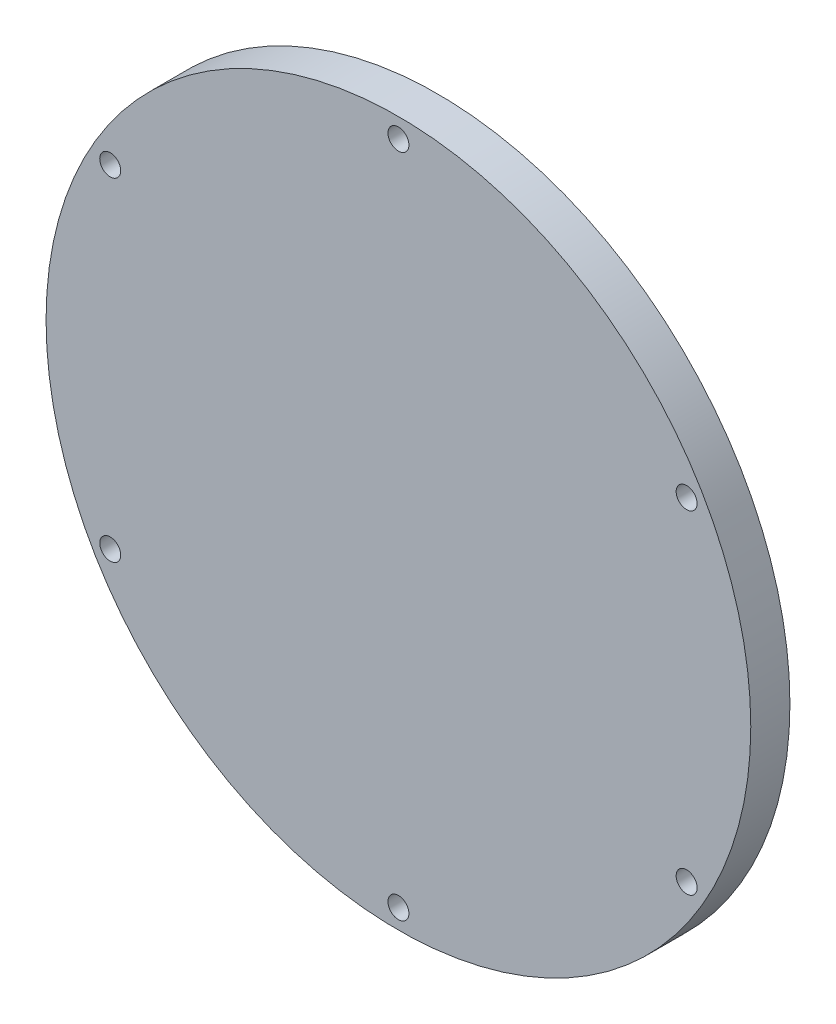
ISO-10303-21;
HEADER;
FILE_DESCRIPTION(('STEP AP214'),'2;1');
FILE_NAME('part.step','',(''),(''),'','','');
FILE_SCHEMA(('AUTOMOTIVE_DESIGN { 1 0 10303 214 1 1 1 1 }'));
ENDSEC;
DATA;
#1=APPLICATION_CONTEXT('core data for automotive mechanical design processes');
#2=APPLICATION_PROTOCOL_DEFINITION('international standard','automotive_design',2000,#1);
#3=PRODUCT_CONTEXT('',#1,'mechanical');
#4=PRODUCT('Part','Part','',(#3));
#5=PRODUCT_RELATED_PRODUCT_CATEGORY('part','',(#4));
#6=PRODUCT_DEFINITION_FORMATION('','',#4);
#7=PRODUCT_DEFINITION_CONTEXT('part definition',#1,'design');
#8=PRODUCT_DEFINITION('design','',#6,#7);
#9=PRODUCT_DEFINITION_SHAPE('','',#8);
#10=(LENGTH_UNIT() NAMED_UNIT(*) SI_UNIT(.MILLI.,.METRE.));
#11=(NAMED_UNIT(*) PLANE_ANGLE_UNIT() SI_UNIT($,.RADIAN.));
#12=(NAMED_UNIT(*) SI_UNIT($,.STERADIAN.) SOLID_ANGLE_UNIT());
#13=UNCERTAINTY_MEASURE_WITH_UNIT(LENGTH_MEASURE(1.E-05),#10,'distance_accuracy_value','');
#14=(GEOMETRIC_REPRESENTATION_CONTEXT(3) GLOBAL_UNCERTAINTY_ASSIGNED_CONTEXT((#13)) GLOBAL_UNIT_ASSIGNED_CONTEXT((#10,
#11,#12)) REPRESENTATION_CONTEXT('',''));
#15=CARTESIAN_POINT('',(0.,0.,0.));
#16=DIRECTION('',(0.,0.,1.));
#17=DIRECTION('',(1.,0.,0.));
#18=AXIS2_PLACEMENT_3D('',#15,#16,#17);
#19=CARTESIAN_POINT('',(0.,0.,6.35));
#20=DIRECTION('',(0.,0.,-1.));
#21=DIRECTION('',(-1.,0.,0.));
#22=AXIS2_PLACEMENT_3D('',#19,#20,#21);
#23=CYLINDRICAL_SURFACE('',#22,57.15);
#24=CARTESIAN_POINT('',(0.,0.,6.35));
#25=DIRECTION('',(0.,0.,1.));
#26=DIRECTION('',(1.,0.,0.));
#27=AXIS2_PLACEMENT_3D('',#24,#25,#26);
#28=CIRCLE('',#27,57.15);
#29=CARTESIAN_POINT('',(57.15,0.,6.35));
#30=VERTEX_POINT('',#29);
#31=EDGE_CURVE('E10',#30,#30,#28,.T.);
#32=ORIENTED_EDGE('',*,*,#31,.F.);
#33=EDGE_LOOP('',(#32));
#34=FACE_BOUND('',#33,.T.);
#35=CARTESIAN_POINT('',(0.,0.,0.));
#36=DIRECTION('',(0.,0.,1.));
#37=DIRECTION('',(1.,0.,0.));
#38=AXIS2_PLACEMENT_3D('',#35,#36,#37);
#39=CIRCLE('',#38,57.15);
#40=CARTESIAN_POINT('',(57.15,0.,0.));
#41=VERTEX_POINT('',#40);
#42=EDGE_CURVE('E41',#41,#41,#39,.T.);
#43=ORIENTED_EDGE('',*,*,#42,.T.);
#44=EDGE_LOOP('',(#43));
#45=FACE_BOUND('',#44,.T.);
#46=ADVANCED_FACE('F38',(#34,#45),#23,.T.);
#47=CARTESIAN_POINT('',(0.,0.,6.35));
#48=DIRECTION('',(0.,0.,1.));
#49=DIRECTION('',(1.,0.,0.));
#50=AXIS2_PLACEMENT_3D('',#47,#48,#49);
#51=PLANE('',#50);
#52=CARTESIAN_POINT('',(-46.7437211692648,26.9875000000005,6.35));
#53=DIRECTION('',(0.,0.,1.));
#54=DIRECTION('',(0.50000000000001,0.866025403784433,0.));
#55=AXIS2_PLACEMENT_3D('',#52,#53,#54);
#56=CIRCLE('',#55,1.7);
#57=CARTESIAN_POINT('',(-45.8937211692647,28.4597431864341,6.35));
#58=VERTEX_POINT('',#57);
#59=EDGE_CURVE('E62',#58,#58,#56,.T.);
#60=ORIENTED_EDGE('',*,*,#59,.F.);
#61=EDGE_LOOP('',(#60));
#62=FACE_BOUND('',#61,.T.);
#63=CARTESIAN_POINT('',(-46.7437211692653,-26.9874999999996,6.35));
#64=DIRECTION('',(0.,0.,1.));
#65=DIRECTION('',(-0.499999999999992,0.866025403784443,0.));
#66=AXIS2_PLACEMENT_3D('',#63,#64,#65);
#67=CIRCLE('',#66,1.7);
#68=CARTESIAN_POINT('',(-47.5937211692653,-25.515256813566,6.35));
#69=VERTEX_POINT('',#68);
#70=EDGE_CURVE('E68',#69,#69,#67,.T.);
#71=ORIENTED_EDGE('',*,*,#70,.F.);
#72=EDGE_LOOP('',(#71));
#73=FACE_BOUND('',#72,.T.);
#74=CARTESIAN_POINT('',(0.,-53.975,6.35));
#75=DIRECTION('',(0.,0.,1.));
#76=DIRECTION('',(-1.,0.,0.));
#77=AXIS2_PLACEMENT_3D('',#74,#75,#76);
#78=CIRCLE('',#77,1.7);
#79=CARTESIAN_POINT('',(-1.7,-53.975,6.35));
#80=VERTEX_POINT('',#79);
#81=EDGE_CURVE('E74',#80,#80,#78,.T.);
#82=ORIENTED_EDGE('',*,*,#81,.F.);
#83=EDGE_LOOP('',(#82));
#84=FACE_BOUND('',#83,.T.);
#85=CARTESIAN_POINT('',(46.743721169265,-26.9875000000002,6.35));
#86=DIRECTION('',(0.,0.,1.));
#87=DIRECTION('',(-0.500000000000004,-0.866025403784436,0.));
#88=AXIS2_PLACEMENT_3D('',#85,#86,#87);
#89=CIRCLE('',#88,1.7);
#90=CARTESIAN_POINT('',(45.893721169265,-28.4597431864338,6.35));
#91=VERTEX_POINT('',#90);
#92=EDGE_CURVE('E80',#91,#91,#89,.T.);
#93=ORIENTED_EDGE('',*,*,#92,.F.);
#94=EDGE_LOOP('',(#93));
#95=FACE_BOUND('',#94,.T.);
#96=CARTESIAN_POINT('',(46.7437211692651,26.9874999999999,6.35));
#97=DIRECTION('',(0.,0.,1.));
#98=DIRECTION('',(0.499999999999998,-0.86602540378444,0.));
#99=AXIS2_PLACEMENT_3D('',#96,#97,#98);
#100=CIRCLE('',#99,1.7);
#101=CARTESIAN_POINT('',(47.5937211692651,25.5152568135663,6.35));
#102=VERTEX_POINT('',#101);
#103=EDGE_CURVE('E56',#102,#102,#100,.T.);
#104=ORIENTED_EDGE('',*,*,#103,.F.);
#105=EDGE_LOOP('',(#104));
#106=FACE_BOUND('',#105,.T.);
#107=CARTESIAN_POINT('',(0.,53.975,6.35));
#108=DIRECTION('',(0.,0.,1.));
#109=DIRECTION('',(1.,0.,0.));
#110=AXIS2_PLACEMENT_3D('',#107,#108,#109);
#111=CIRCLE('',#110,1.7);
#112=CARTESIAN_POINT('',(1.7,53.975,6.35));
#113=VERTEX_POINT('',#112);
#114=EDGE_CURVE('E50',#113,#113,#111,.T.);
#115=ORIENTED_EDGE('',*,*,#114,.F.);
#116=EDGE_LOOP('',(#115));
#117=FACE_BOUND('',#116,.T.);
#118=ORIENTED_EDGE('',*,*,#31,.T.);
#119=EDGE_LOOP('',(#118));
#120=FACE_BOUND('',#119,.T.);
#121=ADVANCED_FACE('F97',(#62,#73,#84,#95,#106,#117,#120),#51,.T.);
#122=CARTESIAN_POINT('',(0.,0.,0.));
#123=DIRECTION('',(0.,0.,1.));
#124=DIRECTION('',(1.,0.,0.));
#125=AXIS2_PLACEMENT_3D('',#122,#123,#124);
#126=PLANE('',#125);
#127=CARTESIAN_POINT('',(-46.7437211692648,26.9875000000005,0.));
#128=DIRECTION('',(0.,0.,1.));
#129=DIRECTION('',(0.50000000000001,0.866025403784433,0.));
#130=AXIS2_PLACEMENT_3D('',#127,#128,#129);
#131=CIRCLE('',#130,1.7);
#132=CARTESIAN_POINT('',(-45.8937211692647,28.4597431864341,0.));
#133=VERTEX_POINT('',#132);
#134=EDGE_CURVE('E65',#133,#133,#131,.T.);
#135=ORIENTED_EDGE('',*,*,#134,.T.);
#136=EDGE_LOOP('',(#135));
#137=FACE_BOUND('',#136,.T.);
#138=CARTESIAN_POINT('',(-46.7437211692653,-26.9874999999996,0.));
#139=DIRECTION('',(0.,0.,1.));
#140=DIRECTION('',(-0.499999999999992,0.866025403784443,0.));
#141=AXIS2_PLACEMENT_3D('',#138,#139,#140);
#142=CIRCLE('',#141,1.7);
#143=CARTESIAN_POINT('',(-47.5937211692653,-25.515256813566,0.));
#144=VERTEX_POINT('',#143);
#145=EDGE_CURVE('E71',#144,#144,#142,.T.);
#146=ORIENTED_EDGE('',*,*,#145,.T.);
#147=EDGE_LOOP('',(#146));
#148=FACE_BOUND('',#147,.T.);
#149=CARTESIAN_POINT('',(0.,-53.975,0.));
#150=DIRECTION('',(0.,0.,1.));
#151=DIRECTION('',(-1.,0.,0.));
#152=AXIS2_PLACEMENT_3D('',#149,#150,#151);
#153=CIRCLE('',#152,1.7);
#154=CARTESIAN_POINT('',(-1.7,-53.975,0.));
#155=VERTEX_POINT('',#154);
#156=EDGE_CURVE('E77',#155,#155,#153,.T.);
#157=ORIENTED_EDGE('',*,*,#156,.T.);
#158=EDGE_LOOP('',(#157));
#159=FACE_BOUND('',#158,.T.);
#160=CARTESIAN_POINT('',(46.743721169265,-26.9875000000002,0.));
#161=DIRECTION('',(0.,0.,1.));
#162=DIRECTION('',(-0.500000000000004,-0.866025403784436,0.));
#163=AXIS2_PLACEMENT_3D('',#160,#161,#162);
#164=CIRCLE('',#163,1.7);
#165=CARTESIAN_POINT('',(45.893721169265,-28.4597431864338,0.));
#166=VERTEX_POINT('',#165);
#167=EDGE_CURVE('E59',#166,#166,#164,.T.);
#168=ORIENTED_EDGE('',*,*,#167,.T.);
#169=EDGE_LOOP('',(#168));
#170=FACE_BOUND('',#169,.T.);
#171=CARTESIAN_POINT('',(46.7437211692651,26.9874999999999,0.));
#172=DIRECTION('',(0.,0.,1.));
#173=DIRECTION('',(0.499999999999998,-0.86602540378444,0.));
#174=AXIS2_PLACEMENT_3D('',#171,#172,#173);
#175=CIRCLE('',#174,1.7);
#176=CARTESIAN_POINT('',(47.5937211692651,25.5152568135663,0.));
#177=VERTEX_POINT('',#176);
#178=EDGE_CURVE('E53',#177,#177,#175,.T.);
#179=ORIENTED_EDGE('',*,*,#178,.T.);
#180=EDGE_LOOP('',(#179));
#181=FACE_BOUND('',#180,.T.);
#182=CARTESIAN_POINT('',(0.,53.975,0.));
#183=DIRECTION('',(0.,0.,1.));
#184=DIRECTION('',(1.,0.,0.));
#185=AXIS2_PLACEMENT_3D('',#182,#183,#184);
#186=CIRCLE('',#185,1.7);
#187=CARTESIAN_POINT('',(1.7,53.975,0.));
#188=VERTEX_POINT('',#187);
#189=EDGE_CURVE('E48',#188,#188,#186,.T.);
#190=ORIENTED_EDGE('',*,*,#189,.T.);
#191=EDGE_LOOP('',(#190));
#192=FACE_BOUND('',#191,.T.);
#193=ORIENTED_EDGE('',*,*,#42,.F.);
#194=EDGE_LOOP('',(#193));
#195=FACE_BOUND('',#194,.T.);
#196=ADVANCED_FACE('F86',(#137,#148,#159,#170,#181,#192,#195),#126,.F.);
#197=CARTESIAN_POINT('',(0.,53.975,0.));
#198=DIRECTION('',(0.,0.,1.));
#199=DIRECTION('',(1.,0.,0.));
#200=AXIS2_PLACEMENT_3D('',#197,#198,#199);
#201=CYLINDRICAL_SURFACE('',#200,1.7);
#202=ORIENTED_EDGE('',*,*,#189,.F.);
#203=EDGE_LOOP('',(#202));
#204=FACE_BOUND('',#203,.T.);
#205=ORIENTED_EDGE('',*,*,#114,.T.);
#206=EDGE_LOOP('',(#205));
#207=FACE_BOUND('',#206,.T.);
#208=ADVANCED_FACE('F106',(#204,#207),#201,.F.);
#209=CARTESIAN_POINT('',(46.7437211692651,26.9874999999999,0.));
#210=DIRECTION('',(0.,0.,1.));
#211=DIRECTION('',(1.,0.,0.));
#212=AXIS2_PLACEMENT_3D('',#209,#210,#211);
#213=CYLINDRICAL_SURFACE('',#212,1.7);
#214=ORIENTED_EDGE('',*,*,#178,.F.);
#215=EDGE_LOOP('',(#214));
#216=FACE_BOUND('',#215,.T.);
#217=ORIENTED_EDGE('',*,*,#103,.T.);
#218=EDGE_LOOP('',(#217));
#219=FACE_BOUND('',#218,.T.);
#220=ADVANCED_FACE('F93',(#216,#219),#213,.F.);
#221=CARTESIAN_POINT('',(46.743721169265,-26.9875000000002,0.));
#222=DIRECTION('',(0.,0.,1.));
#223=DIRECTION('',(1.,0.,0.));
#224=AXIS2_PLACEMENT_3D('',#221,#222,#223);
#225=CYLINDRICAL_SURFACE('',#224,1.7);
#226=ORIENTED_EDGE('',*,*,#167,.F.);
#227=EDGE_LOOP('',(#226));
#228=FACE_BOUND('',#227,.T.);
#229=ORIENTED_EDGE('',*,*,#92,.T.);
#230=EDGE_LOOP('',(#229));
#231=FACE_BOUND('',#230,.T.);
#232=ADVANCED_FACE('F89',(#228,#231),#225,.F.);
#233=CARTESIAN_POINT('',(0.,-53.975,0.));
#234=DIRECTION('',(0.,0.,1.));
#235=DIRECTION('',(1.,0.,0.));
#236=AXIS2_PLACEMENT_3D('',#233,#234,#235);
#237=CYLINDRICAL_SURFACE('',#236,1.7);
#238=ORIENTED_EDGE('',*,*,#156,.F.);
#239=EDGE_LOOP('',(#238));
#240=FACE_BOUND('',#239,.T.);
#241=ORIENTED_EDGE('',*,*,#81,.T.);
#242=EDGE_LOOP('',(#241));
#243=FACE_BOUND('',#242,.T.);
#244=ADVANCED_FACE('F92',(#240,#243),#237,.F.);
#245=CARTESIAN_POINT('',(-46.7437211692653,-26.9874999999996,0.));
#246=DIRECTION('',(0.,0.,1.));
#247=DIRECTION('',(1.,0.,0.));
#248=AXIS2_PLACEMENT_3D('',#245,#246,#247);
#249=CYLINDRICAL_SURFACE('',#248,1.7);
#250=ORIENTED_EDGE('',*,*,#145,.F.);
#251=EDGE_LOOP('',(#250));
#252=FACE_BOUND('',#251,.T.);
#253=ORIENTED_EDGE('',*,*,#70,.T.);
#254=EDGE_LOOP('',(#253));
#255=FACE_BOUND('',#254,.T.);
#256=ADVANCED_FACE('F155',(#252,#255),#249,.F.);
#257=CARTESIAN_POINT('',(-46.7437211692648,26.9875000000005,0.));
#258=DIRECTION('',(0.,0.,1.));
#259=DIRECTION('',(1.,0.,0.));
#260=AXIS2_PLACEMENT_3D('',#257,#258,#259);
#261=CYLINDRICAL_SURFACE('',#260,1.7);
#262=ORIENTED_EDGE('',*,*,#134,.F.);
#263=EDGE_LOOP('',(#262));
#264=FACE_BOUND('',#263,.T.);
#265=ORIENTED_EDGE('',*,*,#59,.T.);
#266=EDGE_LOOP('',(#265));
#267=FACE_BOUND('',#266,.T.);
#268=ADVANCED_FACE('F165',(#264,#267),#261,.F.);
#269=CLOSED_SHELL('',(#46,#121,#196,#208,#220,#232,#244,#256,#268));
#270=MANIFOLD_SOLID_BREP('B2',#269);
#271=ADVANCED_BREP_SHAPE_REPRESENTATION('',(#18,#270),#14);
#272=SHAPE_DEFINITION_REPRESENTATION(#9,#271);
ENDSEC;
END-ISO-10303-21;
